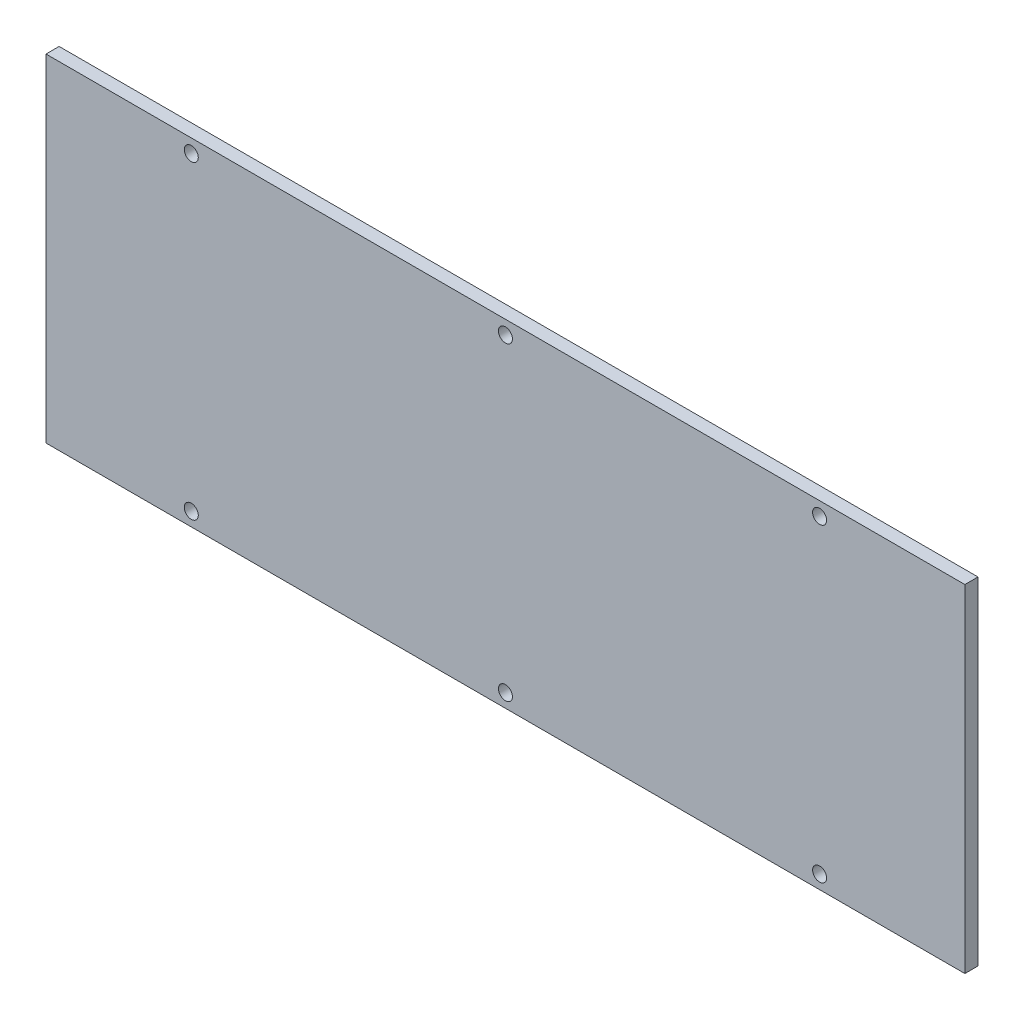
ISO-10303-21;
HEADER;
FILE_DESCRIPTION(('STEP AP214'),'2;1');
FILE_NAME('part.step','',(''),(''),'','','');
FILE_SCHEMA(('AUTOMOTIVE_DESIGN { 1 0 10303 214 1 1 1 1 }'));
ENDSEC;
DATA;
#1=APPLICATION_CONTEXT('core data for automotive mechanical design processes');
#2=APPLICATION_PROTOCOL_DEFINITION('international standard','automotive_design',2000,#1);
#3=PRODUCT_CONTEXT('',#1,'mechanical');
#4=PRODUCT('Part','Part','',(#3));
#5=PRODUCT_RELATED_PRODUCT_CATEGORY('part','',(#4));
#6=PRODUCT_DEFINITION_FORMATION('','',#4);
#7=PRODUCT_DEFINITION_CONTEXT('part definition',#1,'design');
#8=PRODUCT_DEFINITION('design','',#6,#7);
#9=PRODUCT_DEFINITION_SHAPE('','',#8);
#10=(LENGTH_UNIT() NAMED_UNIT(*) SI_UNIT(.MILLI.,.METRE.));
#11=(NAMED_UNIT(*) PLANE_ANGLE_UNIT() SI_UNIT($,.RADIAN.));
#12=(NAMED_UNIT(*) SI_UNIT($,.STERADIAN.) SOLID_ANGLE_UNIT());
#13=UNCERTAINTY_MEASURE_WITH_UNIT(LENGTH_MEASURE(1.E-05),#10,'distance_accuracy_value','');
#14=(GEOMETRIC_REPRESENTATION_CONTEXT(3) GLOBAL_UNCERTAINTY_ASSIGNED_CONTEXT((#13)) GLOBAL_UNIT_ASSIGNED_CONTEXT((#10,
#11,#12)) REPRESENTATION_CONTEXT('',''));
#15=CARTESIAN_POINT('',(0.,0.,0.));
#16=DIRECTION('',(0.,0.,1.));
#17=DIRECTION('',(1.,0.,0.));
#18=AXIS2_PLACEMENT_3D('',#15,#16,#17);
#19=CARTESIAN_POINT('',(-105.,38.5,3.));
#20=DIRECTION('',(0.,0.,1.));
#21=DIRECTION('',(1.,0.,0.));
#22=AXIS2_PLACEMENT_3D('',#19,#20,#21);
#23=PLANE('',#22);
#24=CARTESIAN_POINT('',(0.,-35.4,3.));
#25=DIRECTION('',(0.,0.,1.));
#26=DIRECTION('',(-1.,0.,0.));
#27=AXIS2_PLACEMENT_3D('',#24,#25,#26);
#28=CIRCLE('',#27,1.6);
#29=CARTESIAN_POINT('',(-1.6,-35.4,3.));
#30=VERTEX_POINT('',#29);
#31=EDGE_CURVE('E131',#30,#30,#28,.T.);
#32=ORIENTED_EDGE('',*,*,#31,.F.);
#33=EDGE_LOOP('',(#32));
#34=FACE_BOUND('',#33,.T.);
#35=CARTESIAN_POINT('',(71.8,35.4,3.));
#36=DIRECTION('',(0.,0.,1.));
#37=DIRECTION('',(1.,0.,0.));
#38=AXIS2_PLACEMENT_3D('',#35,#36,#37);
#39=CIRCLE('',#38,1.60000000000001);
#40=CARTESIAN_POINT('',(73.4,35.4,3.));
#41=VERTEX_POINT('',#40);
#42=EDGE_CURVE('E119',#41,#41,#39,.T.);
#43=ORIENTED_EDGE('',*,*,#42,.F.);
#44=EDGE_LOOP('',(#43));
#45=FACE_BOUND('',#44,.T.);
#46=CARTESIAN_POINT('',(0.,35.4,3.));
#47=DIRECTION('',(0.,0.,1.));
#48=DIRECTION('',(1.,0.,0.));
#49=AXIS2_PLACEMENT_3D('',#46,#47,#48);
#50=CIRCLE('',#49,1.6);
#51=CARTESIAN_POINT('',(1.6,35.4,3.));
#52=VERTEX_POINT('',#51);
#53=EDGE_CURVE('E98',#52,#52,#50,.T.);
#54=ORIENTED_EDGE('',*,*,#53,.F.);
#55=EDGE_LOOP('',(#54));
#56=FACE_BOUND('',#55,.T.);
#57=DIRECTION('',(0.,-1.,0.));
#58=VECTOR('',#57,1.);
#59=CARTESIAN_POINT('',(-105.,-38.5,3.));
#60=LINE('',#59,#58);
#61=CARTESIAN_POINT('',(-105.,38.5,3.));
#62=VERTEX_POINT('',#61);
#63=CARTESIAN_POINT('',(-105.,-38.5,3.));
#64=VERTEX_POINT('',#63);
#65=EDGE_CURVE('E83',#62,#64,#60,.T.);
#66=ORIENTED_EDGE('',*,*,#65,.T.);
#67=DIRECTION('',(1.,0.,0.));
#68=VECTOR('',#67,1.);
#69=CARTESIAN_POINT('',(105.,-38.5,3.));
#70=LINE('',#69,#68);
#71=CARTESIAN_POINT('',(105.,-38.5,3.));
#72=VERTEX_POINT('',#71);
#73=EDGE_CURVE('E78',#64,#72,#70,.T.);
#74=ORIENTED_EDGE('',*,*,#73,.T.);
#75=DIRECTION('',(0.,1.,0.));
#76=VECTOR('',#75,1.);
#77=CARTESIAN_POINT('',(105.,-38.5,3.));
#78=LINE('',#77,#76);
#79=CARTESIAN_POINT('',(105.,38.5,3.));
#80=VERTEX_POINT('',#79);
#81=EDGE_CURVE('E81',#72,#80,#78,.T.);
#82=ORIENTED_EDGE('',*,*,#81,.T.);
#83=DIRECTION('',(-1.,0.,0.));
#84=VECTOR('',#83,1.);
#85=CARTESIAN_POINT('',(105.,38.5,3.));
#86=LINE('',#85,#84);
#87=EDGE_CURVE('E48',#80,#62,#86,.T.);
#88=ORIENTED_EDGE('',*,*,#87,.T.);
#89=EDGE_LOOP('',(#66,#74,#82,#88));
#90=FACE_BOUND('',#89,.T.);
#91=CARTESIAN_POINT('',(-71.8,35.4,3.));
#92=DIRECTION('',(0.,0.,1.));
#93=DIRECTION('',(1.,0.,0.));
#94=AXIS2_PLACEMENT_3D('',#91,#92,#93);
#95=CIRCLE('',#94,1.60000000000001);
#96=CARTESIAN_POINT('',(-70.2,35.4,3.));
#97=VERTEX_POINT('',#96);
#98=EDGE_CURVE('E113',#97,#97,#95,.T.);
#99=ORIENTED_EDGE('',*,*,#98,.F.);
#100=EDGE_LOOP('',(#99));
#101=FACE_BOUND('',#100,.T.);
#102=CARTESIAN_POINT('',(71.8,-35.4,3.));
#103=DIRECTION('',(0.,0.,1.));
#104=DIRECTION('',(-1.,0.,0.));
#105=AXIS2_PLACEMENT_3D('',#102,#103,#104);
#106=CIRCLE('',#105,1.60000000000001);
#107=CARTESIAN_POINT('',(70.2,-35.4,3.));
#108=VERTEX_POINT('',#107);
#109=EDGE_CURVE('E125',#108,#108,#106,.T.);
#110=ORIENTED_EDGE('',*,*,#109,.F.);
#111=EDGE_LOOP('',(#110));
#112=FACE_BOUND('',#111,.T.);
#113=CARTESIAN_POINT('',(-71.8,-35.4,3.));
#114=DIRECTION('',(0.,0.,1.));
#115=DIRECTION('',(-1.,0.,0.));
#116=AXIS2_PLACEMENT_3D('',#113,#114,#115);
#117=CIRCLE('',#116,1.60000000000001);
#118=CARTESIAN_POINT('',(-73.4,-35.4,3.));
#119=VERTEX_POINT('',#118);
#120=EDGE_CURVE('E137',#119,#119,#117,.T.);
#121=ORIENTED_EDGE('',*,*,#120,.F.);
#122=EDGE_LOOP('',(#121));
#123=FACE_BOUND('',#122,.T.);
#124=ADVANCED_FACE('F31',(#34,#45,#56,#90,#101,#112,#123),#23,.T.);
#125=CARTESIAN_POINT('',(-105.,38.5,0.));
#126=DIRECTION('',(0.,0.,1.));
#127=DIRECTION('',(1.,0.,0.));
#128=AXIS2_PLACEMENT_3D('',#125,#126,#127);
#129=PLANE('',#128);
#130=CARTESIAN_POINT('',(0.,-35.4,0.));
#131=DIRECTION('',(0.,0.,1.));
#132=DIRECTION('',(-1.,0.,0.));
#133=AXIS2_PLACEMENT_3D('',#130,#131,#132);
#134=CIRCLE('',#133,1.6);
#135=CARTESIAN_POINT('',(-1.6,-35.4,0.));
#136=VERTEX_POINT('',#135);
#137=EDGE_CURVE('E134',#136,#136,#134,.T.);
#138=ORIENTED_EDGE('',*,*,#137,.T.);
#139=EDGE_LOOP('',(#138));
#140=FACE_BOUND('',#139,.T.);
#141=CARTESIAN_POINT('',(71.8,35.4,0.));
#142=DIRECTION('',(0.,0.,1.));
#143=DIRECTION('',(1.,0.,0.));
#144=AXIS2_PLACEMENT_3D('',#141,#142,#143);
#145=CIRCLE('',#144,1.60000000000001);
#146=CARTESIAN_POINT('',(73.4,35.4,0.));
#147=VERTEX_POINT('',#146);
#148=EDGE_CURVE('E122',#147,#147,#145,.T.);
#149=ORIENTED_EDGE('',*,*,#148,.T.);
#150=EDGE_LOOP('',(#149));
#151=FACE_BOUND('',#150,.T.);
#152=CARTESIAN_POINT('',(0.,35.4,0.));
#153=DIRECTION('',(0.,0.,1.));
#154=DIRECTION('',(1.,0.,0.));
#155=AXIS2_PLACEMENT_3D('',#152,#153,#154);
#156=CIRCLE('',#155,1.6);
#157=CARTESIAN_POINT('',(1.6,35.4,0.));
#158=VERTEX_POINT('',#157);
#159=EDGE_CURVE('E110',#158,#158,#156,.T.);
#160=ORIENTED_EDGE('',*,*,#159,.T.);
#161=EDGE_LOOP('',(#160));
#162=FACE_BOUND('',#161,.T.);
#163=DIRECTION('',(0.,-1.,0.));
#164=VECTOR('',#163,1.);
#165=CARTESIAN_POINT('',(-105.,-38.5,0.));
#166=LINE('',#165,#164);
#167=CARTESIAN_POINT('',(-105.,38.5,0.));
#168=VERTEX_POINT('',#167);
#169=CARTESIAN_POINT('',(-105.,-38.5,0.));
#170=VERTEX_POINT('',#169);
#171=EDGE_CURVE('E95',#168,#170,#166,.T.);
#172=ORIENTED_EDGE('',*,*,#171,.F.);
#173=DIRECTION('',(-1.,0.,0.));
#174=VECTOR('',#173,1.);
#175=CARTESIAN_POINT('',(105.,38.5,0.));
#176=LINE('',#175,#174);
#177=CARTESIAN_POINT('',(105.,38.5,0.));
#178=VERTEX_POINT('',#177);
#179=EDGE_CURVE('E71',#178,#168,#176,.T.);
#180=ORIENTED_EDGE('',*,*,#179,.F.);
#181=DIRECTION('',(0.,1.,0.));
#182=VECTOR('',#181,1.);
#183=CARTESIAN_POINT('',(105.,-38.5,0.));
#184=LINE('',#183,#182);
#185=CARTESIAN_POINT('',(105.,-38.5,0.));
#186=VERTEX_POINT('',#185);
#187=EDGE_CURVE('E65',#186,#178,#184,.T.);
#188=ORIENTED_EDGE('',*,*,#187,.F.);
#189=DIRECTION('',(1.,0.,0.));
#190=VECTOR('',#189,1.);
#191=CARTESIAN_POINT('',(105.,-38.5,0.));
#192=LINE('',#191,#190);
#193=EDGE_CURVE('E87',#170,#186,#192,.T.);
#194=ORIENTED_EDGE('',*,*,#193,.F.);
#195=EDGE_LOOP('',(#172,#180,#188,#194));
#196=FACE_BOUND('',#195,.T.);
#197=CARTESIAN_POINT('',(-71.8,35.4,0.));
#198=DIRECTION('',(0.,0.,1.));
#199=DIRECTION('',(1.,0.,0.));
#200=AXIS2_PLACEMENT_3D('',#197,#198,#199);
#201=CIRCLE('',#200,1.60000000000001);
#202=CARTESIAN_POINT('',(-70.2,35.4,0.));
#203=VERTEX_POINT('',#202);
#204=EDGE_CURVE('E116',#203,#203,#201,.T.);
#205=ORIENTED_EDGE('',*,*,#204,.T.);
#206=EDGE_LOOP('',(#205));
#207=FACE_BOUND('',#206,.T.);
#208=CARTESIAN_POINT('',(71.8,-35.4,0.));
#209=DIRECTION('',(0.,0.,1.));
#210=DIRECTION('',(-1.,0.,0.));
#211=AXIS2_PLACEMENT_3D('',#208,#209,#210);
#212=CIRCLE('',#211,1.60000000000001);
#213=CARTESIAN_POINT('',(70.2,-35.4,0.));
#214=VERTEX_POINT('',#213);
#215=EDGE_CURVE('E128',#214,#214,#212,.T.);
#216=ORIENTED_EDGE('',*,*,#215,.T.);
#217=EDGE_LOOP('',(#216));
#218=FACE_BOUND('',#217,.T.);
#219=CARTESIAN_POINT('',(-71.8,-35.4,0.));
#220=DIRECTION('',(0.,0.,1.));
#221=DIRECTION('',(-1.,0.,0.));
#222=AXIS2_PLACEMENT_3D('',#219,#220,#221);
#223=CIRCLE('',#222,1.60000000000001);
#224=CARTESIAN_POINT('',(-73.4,-35.4,0.));
#225=VERTEX_POINT('',#224);
#226=EDGE_CURVE('E140',#225,#225,#223,.T.);
#227=ORIENTED_EDGE('',*,*,#226,.T.);
#228=EDGE_LOOP('',(#227));
#229=FACE_BOUND('',#228,.T.);
#230=ADVANCED_FACE('F106',(#140,#151,#162,#196,#207,#218,#229),#129,.F.);
#231=CARTESIAN_POINT('',(-105.,-38.5,3.));
#232=DIRECTION('',(1.,0.,0.));
#233=DIRECTION('',(0.,0.,-1.));
#234=AXIS2_PLACEMENT_3D('',#231,#232,#233);
#235=PLANE('',#234);
#236=ORIENTED_EDGE('',*,*,#171,.T.);
#237=DIRECTION('',(0.,0.,-1.));
#238=VECTOR('',#237,1.);
#239=CARTESIAN_POINT('',(-105.,-38.5,3.));
#240=LINE('',#239,#238);
#241=EDGE_CURVE('E11',#64,#170,#240,.T.);
#242=ORIENTED_EDGE('',*,*,#241,.F.);
#243=ORIENTED_EDGE('',*,*,#65,.F.);
#244=DIRECTION('',(0.,0.,-1.));
#245=VECTOR('',#244,1.);
#246=CARTESIAN_POINT('',(-105.,38.5,3.));
#247=LINE('',#246,#245);
#248=EDGE_CURVE('E91',#62,#168,#247,.T.);
#249=ORIENTED_EDGE('',*,*,#248,.T.);
#250=EDGE_LOOP('',(#236,#242,#243,#249));
#251=FACE_BOUND('',#250,.T.);
#252=ADVANCED_FACE('F33',(#251),#235,.F.);
#253=CARTESIAN_POINT('',(105.,-38.5,3.));
#254=DIRECTION('',(0.,1.,0.));
#255=DIRECTION('',(-1.,0.,0.));
#256=AXIS2_PLACEMENT_3D('',#253,#254,#255);
#257=PLANE('',#256);
#258=ORIENTED_EDGE('',*,*,#193,.T.);
#259=DIRECTION('',(0.,0.,-1.));
#260=VECTOR('',#259,1.);
#261=CARTESIAN_POINT('',(105.,-38.5,3.));
#262=LINE('',#261,#260);
#263=EDGE_CURVE('E40',#72,#186,#262,.T.);
#264=ORIENTED_EDGE('',*,*,#263,.F.);
#265=ORIENTED_EDGE('',*,*,#73,.F.);
#266=ORIENTED_EDGE('',*,*,#241,.T.);
#267=EDGE_LOOP('',(#258,#264,#265,#266));
#268=FACE_BOUND('',#267,.T.);
#269=ADVANCED_FACE('F86',(#268),#257,.F.);
#270=CARTESIAN_POINT('',(105.,-38.5,3.));
#271=DIRECTION('',(-1.,0.,0.));
#272=DIRECTION('',(0.,0.,1.));
#273=AXIS2_PLACEMENT_3D('',#270,#271,#272);
#274=PLANE('',#273);
#275=ORIENTED_EDGE('',*,*,#187,.T.);
#276=DIRECTION('',(0.,0.,-1.));
#277=VECTOR('',#276,1.);
#278=CARTESIAN_POINT('',(105.,38.5,3.));
#279=LINE('',#278,#277);
#280=EDGE_CURVE('E88',#80,#178,#279,.T.);
#281=ORIENTED_EDGE('',*,*,#280,.F.);
#282=ORIENTED_EDGE('',*,*,#81,.F.);
#283=ORIENTED_EDGE('',*,*,#263,.T.);
#284=EDGE_LOOP('',(#275,#281,#282,#283));
#285=FACE_BOUND('',#284,.T.);
#286=ADVANCED_FACE('F89',(#285),#274,.F.);
#287=CARTESIAN_POINT('',(105.,38.5,3.));
#288=DIRECTION('',(0.,-1.,0.));
#289=DIRECTION('',(1.,0.,0.));
#290=AXIS2_PLACEMENT_3D('',#287,#288,#289);
#291=PLANE('',#290);
#292=ORIENTED_EDGE('',*,*,#179,.T.);
#293=ORIENTED_EDGE('',*,*,#248,.F.);
#294=ORIENTED_EDGE('',*,*,#87,.F.);
#295=ORIENTED_EDGE('',*,*,#280,.T.);
#296=EDGE_LOOP('',(#292,#293,#294,#295));
#297=FACE_BOUND('',#296,.T.);
#298=ADVANCED_FACE('F103',(#297),#291,.F.);
#299=CARTESIAN_POINT('',(0.,35.4,3.));
#300=DIRECTION('',(0.,0.,-1.));
#301=DIRECTION('',(-1.,0.,0.));
#302=AXIS2_PLACEMENT_3D('',#299,#300,#301);
#303=CYLINDRICAL_SURFACE('',#302,1.6);
#304=ORIENTED_EDGE('',*,*,#53,.T.);
#305=EDGE_LOOP('',(#304));
#306=FACE_BOUND('',#305,.T.);
#307=ORIENTED_EDGE('',*,*,#159,.F.);
#308=EDGE_LOOP('',(#307));
#309=FACE_BOUND('',#308,.T.);
#310=ADVANCED_FACE('F160',(#306,#309),#303,.F.);
#311=CARTESIAN_POINT('',(-71.8,35.4,3.));
#312=DIRECTION('',(0.,0.,-1.));
#313=DIRECTION('',(-1.,0.,0.));
#314=AXIS2_PLACEMENT_3D('',#311,#312,#313);
#315=CYLINDRICAL_SURFACE('',#314,1.60000000000001);
#316=ORIENTED_EDGE('',*,*,#98,.T.);
#317=EDGE_LOOP('',(#316));
#318=FACE_BOUND('',#317,.T.);
#319=ORIENTED_EDGE('',*,*,#204,.F.);
#320=EDGE_LOOP('',(#319));
#321=FACE_BOUND('',#320,.T.);
#322=ADVANCED_FACE('F206',(#318,#321),#315,.F.);
#323=CARTESIAN_POINT('',(71.8,35.4,3.));
#324=DIRECTION('',(0.,0.,-1.));
#325=DIRECTION('',(-1.,0.,0.));
#326=AXIS2_PLACEMENT_3D('',#323,#324,#325);
#327=CYLINDRICAL_SURFACE('',#326,1.60000000000001);
#328=ORIENTED_EDGE('',*,*,#42,.T.);
#329=EDGE_LOOP('',(#328));
#330=FACE_BOUND('',#329,.T.);
#331=ORIENTED_EDGE('',*,*,#148,.F.);
#332=EDGE_LOOP('',(#331));
#333=FACE_BOUND('',#332,.T.);
#334=ADVANCED_FACE('F214',(#330,#333),#327,.F.);
#335=CARTESIAN_POINT('',(71.8,-35.4,3.));
#336=DIRECTION('',(0.,0.,-1.));
#337=DIRECTION('',(-1.,0.,0.));
#338=AXIS2_PLACEMENT_3D('',#335,#336,#337);
#339=CYLINDRICAL_SURFACE('',#338,1.60000000000001);
#340=ORIENTED_EDGE('',*,*,#109,.T.);
#341=EDGE_LOOP('',(#340));
#342=FACE_BOUND('',#341,.T.);
#343=ORIENTED_EDGE('',*,*,#215,.F.);
#344=EDGE_LOOP('',(#343));
#345=FACE_BOUND('',#344,.T.);
#346=ADVANCED_FACE('F222',(#342,#345),#339,.F.);
#347=CARTESIAN_POINT('',(0.,-35.4,3.));
#348=DIRECTION('',(0.,0.,-1.));
#349=DIRECTION('',(-1.,0.,0.));
#350=AXIS2_PLACEMENT_3D('',#347,#348,#349);
#351=CYLINDRICAL_SURFACE('',#350,1.6);
#352=ORIENTED_EDGE('',*,*,#31,.T.);
#353=EDGE_LOOP('',(#352));
#354=FACE_BOUND('',#353,.T.);
#355=ORIENTED_EDGE('',*,*,#137,.F.);
#356=EDGE_LOOP('',(#355));
#357=FACE_BOUND('',#356,.T.);
#358=ADVANCED_FACE('F231',(#354,#357),#351,.F.);
#359=CARTESIAN_POINT('',(-71.8,-35.4,3.));
#360=DIRECTION('',(0.,0.,-1.));
#361=DIRECTION('',(-1.,0.,0.));
#362=AXIS2_PLACEMENT_3D('',#359,#360,#361);
#363=CYLINDRICAL_SURFACE('',#362,1.60000000000001);
#364=ORIENTED_EDGE('',*,*,#120,.T.);
#365=EDGE_LOOP('',(#364));
#366=FACE_BOUND('',#365,.T.);
#367=ORIENTED_EDGE('',*,*,#226,.F.);
#368=EDGE_LOOP('',(#367));
#369=FACE_BOUND('',#368,.T.);
#370=ADVANCED_FACE('F146',(#366,#369),#363,.F.);
#371=CLOSED_SHELL('',(#124,#230,#252,#269,#286,#298,#310,#322,#334,#346,#358,#370));
#372=MANIFOLD_SOLID_BREP('B2',#371);
#373=ADVANCED_BREP_SHAPE_REPRESENTATION('',(#18,#372),#14);
#374=SHAPE_DEFINITION_REPRESENTATION(#9,#373);
ENDSEC;
END-ISO-10303-21;
